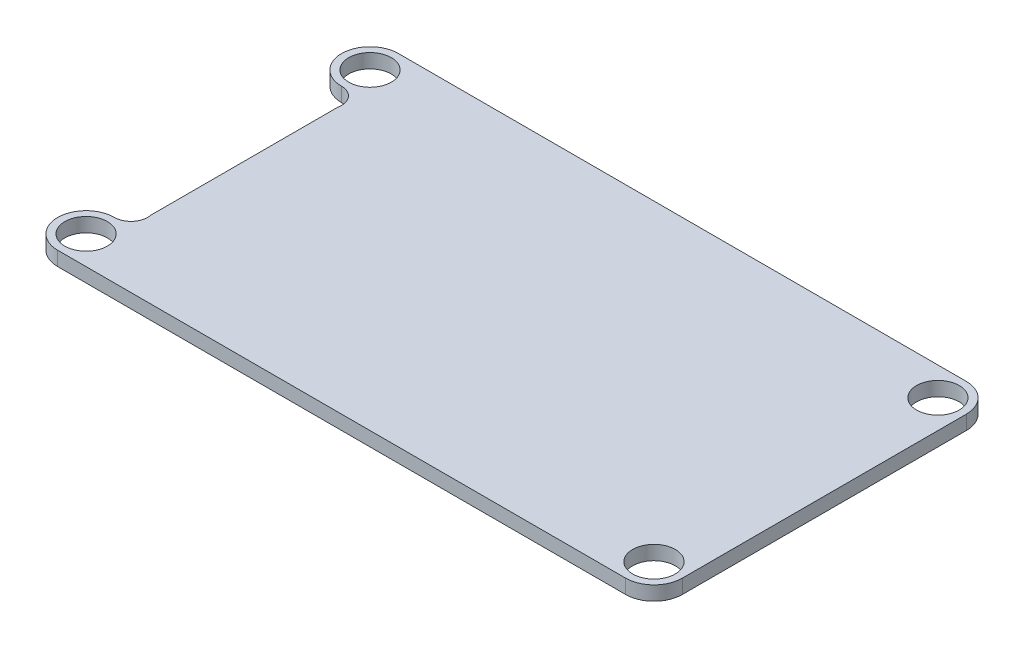
ISO-10303-21;
HEADER;
FILE_DESCRIPTION(('STEP AP214'),'2;1');
FILE_NAME('part.step','',(''),(''),'','','');
FILE_SCHEMA(('AUTOMOTIVE_DESIGN { 1 0 10303 214 1 1 1 1 }'));
ENDSEC;
DATA;
#1=APPLICATION_CONTEXT('core data for automotive mechanical design processes');
#2=APPLICATION_PROTOCOL_DEFINITION('international standard','automotive_design',2000,#1);
#3=PRODUCT_CONTEXT('',#1,'mechanical');
#4=PRODUCT('Part','Part','',(#3));
#5=PRODUCT_RELATED_PRODUCT_CATEGORY('part','',(#4));
#6=PRODUCT_DEFINITION_FORMATION('','',#4);
#7=PRODUCT_DEFINITION_CONTEXT('part definition',#1,'design');
#8=PRODUCT_DEFINITION('design','',#6,#7);
#9=PRODUCT_DEFINITION_SHAPE('','',#8);
#10=(LENGTH_UNIT() NAMED_UNIT(*) SI_UNIT(.MILLI.,.METRE.));
#11=(NAMED_UNIT(*) PLANE_ANGLE_UNIT() SI_UNIT($,.RADIAN.));
#12=(NAMED_UNIT(*) SI_UNIT($,.STERADIAN.) SOLID_ANGLE_UNIT());
#13=UNCERTAINTY_MEASURE_WITH_UNIT(LENGTH_MEASURE(1.E-05),#10,'distance_accuracy_value','');
#14=(GEOMETRIC_REPRESENTATION_CONTEXT(3) GLOBAL_UNCERTAINTY_ASSIGNED_CONTEXT((#13)) GLOBAL_UNIT_ASSIGNED_CONTEXT((#10,
#11,#12)) REPRESENTATION_CONTEXT('',''));
#15=CARTESIAN_POINT('',(0.,0.,0.));
#16=DIRECTION('',(0.,0.,1.));
#17=DIRECTION('',(1.,0.,0.));
#18=AXIS2_PLACEMENT_3D('',#15,#16,#17);
#19=CARTESIAN_POINT('',(-20.,1.,-10.));
#20=DIRECTION('',(0.,1.,0.));
#21=DIRECTION('',(0.,0.,1.));
#22=AXIS2_PLACEMENT_3D('',#19,#20,#21);
#23=PLANE('',#22);
#24=CARTESIAN_POINT('',(20.,1.,10.));
#25=DIRECTION('',(0.,1.,0.));
#26=DIRECTION('',(0.,0.,1.));
#27=AXIS2_PLACEMENT_3D('',#24,#25,#26);
#28=CIRCLE('',#27,1.5);
#29=CARTESIAN_POINT('',(20.,1.,11.5));
#30=VERTEX_POINT('',#29);
#31=EDGE_CURVE('E257',#30,#30,#28,.T.);
#32=ORIENTED_EDGE('',*,*,#31,.F.);
#33=EDGE_LOOP('',(#32));
#34=FACE_BOUND('',#33,.T.);
#35=CARTESIAN_POINT('',(-20.,1.,-10.));
#36=DIRECTION('',(0.,1.,0.));
#37=DIRECTION('',(0.,0.,1.));
#38=AXIS2_PLACEMENT_3D('',#35,#36,#37);
#39=CIRCLE('',#38,1.5);
#40=CARTESIAN_POINT('',(-20.,1.,-8.5));
#41=VERTEX_POINT('',#40);
#42=EDGE_CURVE('E158',#41,#41,#39,.T.);
#43=ORIENTED_EDGE('',*,*,#42,.F.);
#44=EDGE_LOOP('',(#43));
#45=FACE_BOUND('',#44,.T.);
#46=CARTESIAN_POINT('',(-20.,1.,-10.));
#47=DIRECTION('',(0.,1.,0.));
#48=DIRECTION('',(0.,0.,1.));
#49=AXIS2_PLACEMENT_3D('',#46,#47,#48);
#50=CIRCLE('',#49,2.);
#51=CARTESIAN_POINT('',(-20.,1.,-12.));
#52=VERTEX_POINT('',#51);
#53=CARTESIAN_POINT('',(-20.,1.,-8.));
#54=VERTEX_POINT('',#53);
#55=EDGE_CURVE('E182',#52,#54,#50,.T.);
#56=ORIENTED_EDGE('',*,*,#55,.T.);
#57=CARTESIAN_POINT('',(-20.,1.,-6.83585714285715));
#58=DIRECTION('',(0.,-1.,0.));
#59=DIRECTION('',(0.,0.,-1.));
#60=AXIS2_PLACEMENT_3D('',#57,#58,#59);
#61=CIRCLE('',#60,1.16414285714286);
#62=CARTESIAN_POINT('',(-18.86,1.,-6.6));
#63=VERTEX_POINT('',#62);
#64=EDGE_CURVE('E106',#54,#63,#61,.T.);
#65=ORIENTED_EDGE('',*,*,#64,.T.);
#66=DIRECTION('',(0.,0.,1.));
#67=VECTOR('',#66,1.);
#68=CARTESIAN_POINT('',(-18.86,1.,6.6));
#69=LINE('',#68,#67);
#70=CARTESIAN_POINT('',(-18.86,1.,6.6));
#71=VERTEX_POINT('',#70);
#72=EDGE_CURVE('E211',#63,#71,#69,.T.);
#73=ORIENTED_EDGE('',*,*,#72,.T.);
#74=CARTESIAN_POINT('',(-20.,1.,6.83585714285715));
#75=DIRECTION('',(0.,-1.,0.));
#76=DIRECTION('',(0.,0.,1.));
#77=AXIS2_PLACEMENT_3D('',#74,#75,#76);
#78=CIRCLE('',#77,1.16414285714286);
#79=CARTESIAN_POINT('',(-20.,1.,8.));
#80=VERTEX_POINT('',#79);
#81=EDGE_CURVE('E231',#71,#80,#78,.T.);
#82=ORIENTED_EDGE('',*,*,#81,.T.);
#83=CARTESIAN_POINT('',(-20.,1.,10.));
#84=DIRECTION('',(0.,1.,0.));
#85=DIRECTION('',(0.,0.,-1.));
#86=AXIS2_PLACEMENT_3D('',#83,#84,#85);
#87=CIRCLE('',#86,2.);
#88=CARTESIAN_POINT('',(-20.,1.,12.));
#89=VERTEX_POINT('',#88);
#90=EDGE_CURVE('E227',#80,#89,#87,.T.);
#91=ORIENTED_EDGE('',*,*,#90,.T.);
#92=DIRECTION('',(1.,0.,0.));
#93=VECTOR('',#92,1.);
#94=CARTESIAN_POINT('',(20.,1.,12.));
#95=LINE('',#94,#93);
#96=CARTESIAN_POINT('',(20.,1.,12.));
#97=VERTEX_POINT('',#96);
#98=EDGE_CURVE('E230',#89,#97,#95,.T.);
#99=ORIENTED_EDGE('',*,*,#98,.T.);
#100=CARTESIAN_POINT('',(20.,1.,10.));
#101=DIRECTION('',(0.,1.,0.));
#102=DIRECTION('',(0.,0.,-1.));
#103=AXIS2_PLACEMENT_3D('',#100,#101,#102);
#104=CIRCLE('',#103,2.);
#105=CARTESIAN_POINT('',(22.,1.,10.));
#106=VERTEX_POINT('',#105);
#107=EDGE_CURVE('E131',#97,#106,#104,.T.);
#108=ORIENTED_EDGE('',*,*,#107,.T.);
#109=DIRECTION('',(0.,0.,-1.));
#110=VECTOR('',#109,1.);
#111=CARTESIAN_POINT('',(22.,1.,-10.));
#112=LINE('',#111,#110);
#113=CARTESIAN_POINT('',(22.,1.,-10.));
#114=VERTEX_POINT('',#113);
#115=EDGE_CURVE('E125',#106,#114,#112,.T.);
#116=ORIENTED_EDGE('',*,*,#115,.T.);
#117=CARTESIAN_POINT('',(20.,1.,-10.));
#118=DIRECTION('',(0.,1.,0.));
#119=DIRECTION('',(0.,0.,-1.));
#120=AXIS2_PLACEMENT_3D('',#117,#118,#119);
#121=CIRCLE('',#120,2.);
#122=CARTESIAN_POINT('',(20.,1.,-12.));
#123=VERTEX_POINT('',#122);
#124=EDGE_CURVE('E129',#114,#123,#121,.T.);
#125=ORIENTED_EDGE('',*,*,#124,.T.);
#126=DIRECTION('',(-1.,0.,0.));
#127=VECTOR('',#126,1.);
#128=CARTESIAN_POINT('',(-20.,1.,-12.));
#129=LINE('',#128,#127);
#130=EDGE_CURVE('E57',#123,#52,#129,.T.);
#131=ORIENTED_EDGE('',*,*,#130,.T.);
#132=EDGE_LOOP('',(#56,#65,#73,#82,#91,#99,#108,#116,#125,#131));
#133=FACE_BOUND('',#132,.T.);
#134=CARTESIAN_POINT('',(-20.,1.,10.));
#135=DIRECTION('',(0.,1.,0.));
#136=DIRECTION('',(0.,0.,1.));
#137=AXIS2_PLACEMENT_3D('',#134,#135,#136);
#138=CIRCLE('',#137,1.5);
#139=CARTESIAN_POINT('',(-20.,1.,11.5));
#140=VERTEX_POINT('',#139);
#141=EDGE_CURVE('E249',#140,#140,#138,.T.);
#142=ORIENTED_EDGE('',*,*,#141,.F.);
#143=EDGE_LOOP('',(#142));
#144=FACE_BOUND('',#143,.T.);
#145=CARTESIAN_POINT('',(20.,1.,-10.));
#146=DIRECTION('',(0.,1.,0.));
#147=DIRECTION('',(0.,0.,1.));
#148=AXIS2_PLACEMENT_3D('',#145,#146,#147);
#149=CIRCLE('',#148,1.5);
#150=CARTESIAN_POINT('',(20.,1.,-8.5));
#151=VERTEX_POINT('',#150);
#152=EDGE_CURVE('E265',#151,#151,#149,.T.);
#153=ORIENTED_EDGE('',*,*,#152,.F.);
#154=EDGE_LOOP('',(#153));
#155=FACE_BOUND('',#154,.T.);
#156=ADVANCED_FACE('F39',(#34,#45,#133,#144,#155),#23,.T.);
#157=CARTESIAN_POINT('',(-20.,0.,-10.));
#158=DIRECTION('',(0.,1.,0.));
#159=DIRECTION('',(0.,0.,1.));
#160=AXIS2_PLACEMENT_3D('',#157,#158,#159);
#161=PLANE('',#160);
#162=CARTESIAN_POINT('',(-20.,0.,-10.));
#163=DIRECTION('',(0.,1.,0.));
#164=DIRECTION('',(0.,0.,1.));
#165=AXIS2_PLACEMENT_3D('',#162,#163,#164);
#166=CIRCLE('',#165,2.);
#167=CARTESIAN_POINT('',(-20.,0.,-12.));
#168=VERTEX_POINT('',#167);
#169=CARTESIAN_POINT('',(-20.,0.,-8.));
#170=VERTEX_POINT('',#169);
#171=EDGE_CURVE('E153',#168,#170,#166,.T.);
#172=ORIENTED_EDGE('',*,*,#171,.F.);
#173=DIRECTION('',(-1.,0.,0.));
#174=VECTOR('',#173,1.);
#175=CARTESIAN_POINT('',(-20.,0.,-12.));
#176=LINE('',#175,#174);
#177=CARTESIAN_POINT('',(20.,0.,-12.));
#178=VERTEX_POINT('',#177);
#179=EDGE_CURVE('E98',#178,#168,#176,.T.);
#180=ORIENTED_EDGE('',*,*,#179,.F.);
#181=CARTESIAN_POINT('',(20.,0.,-10.));
#182=DIRECTION('',(0.,1.,0.));
#183=DIRECTION('',(0.,0.,-1.));
#184=AXIS2_PLACEMENT_3D('',#181,#182,#183);
#185=CIRCLE('',#184,2.);
#186=CARTESIAN_POINT('',(22.,0.,-10.));
#187=VERTEX_POINT('',#186);
#188=EDGE_CURVE('E92',#187,#178,#185,.T.);
#189=ORIENTED_EDGE('',*,*,#188,.F.);
#190=DIRECTION('',(0.,0.,-1.));
#191=VECTOR('',#190,1.);
#192=CARTESIAN_POINT('',(22.,0.,-10.));
#193=LINE('',#192,#191);
#194=CARTESIAN_POINT('',(22.,0.,10.));
#195=VERTEX_POINT('',#194);
#196=EDGE_CURVE('E140',#195,#187,#193,.T.);
#197=ORIENTED_EDGE('',*,*,#196,.F.);
#198=CARTESIAN_POINT('',(20.,0.,10.));
#199=DIRECTION('',(0.,1.,0.));
#200=DIRECTION('',(0.,0.,-1.));
#201=AXIS2_PLACEMENT_3D('',#198,#199,#200);
#202=CIRCLE('',#201,2.);
#203=CARTESIAN_POINT('',(20.,0.,12.));
#204=VERTEX_POINT('',#203);
#205=EDGE_CURVE('E173',#204,#195,#202,.T.);
#206=ORIENTED_EDGE('',*,*,#205,.F.);
#207=DIRECTION('',(1.,0.,0.));
#208=VECTOR('',#207,1.);
#209=CARTESIAN_POINT('',(20.,0.,12.));
#210=LINE('',#209,#208);
#211=CARTESIAN_POINT('',(-20.,0.,12.));
#212=VERTEX_POINT('',#211);
#213=EDGE_CURVE('E170',#212,#204,#210,.T.);
#214=ORIENTED_EDGE('',*,*,#213,.F.);
#215=CARTESIAN_POINT('',(-20.,0.,10.));
#216=DIRECTION('',(0.,1.,0.));
#217=DIRECTION('',(0.,0.,-1.));
#218=AXIS2_PLACEMENT_3D('',#215,#216,#217);
#219=CIRCLE('',#218,2.);
#220=CARTESIAN_POINT('',(-20.,0.,8.));
#221=VERTEX_POINT('',#220);
#222=EDGE_CURVE('E167',#221,#212,#219,.T.);
#223=ORIENTED_EDGE('',*,*,#222,.F.);
#224=CARTESIAN_POINT('',(-20.,0.,6.83585714285715));
#225=DIRECTION('',(0.,-1.,0.));
#226=DIRECTION('',(0.,0.,1.));
#227=AXIS2_PLACEMENT_3D('',#224,#225,#226);
#228=CIRCLE('',#227,1.16414285714286);
#229=CARTESIAN_POINT('',(-18.86,0.,6.6));
#230=VERTEX_POINT('',#229);
#231=EDGE_CURVE('E164',#230,#221,#228,.T.);
#232=ORIENTED_EDGE('',*,*,#231,.F.);
#233=DIRECTION('',(0.,0.,1.));
#234=VECTOR('',#233,1.);
#235=CARTESIAN_POINT('',(-18.86,0.,6.6));
#236=LINE('',#235,#234);
#237=CARTESIAN_POINT('',(-18.86,0.,-6.6));
#238=VERTEX_POINT('',#237);
#239=EDGE_CURVE('E161',#238,#230,#236,.T.);
#240=ORIENTED_EDGE('',*,*,#239,.F.);
#241=CARTESIAN_POINT('',(-20.,0.,-6.83585714285715));
#242=DIRECTION('',(0.,-1.,0.));
#243=DIRECTION('',(0.,0.,-1.));
#244=AXIS2_PLACEMENT_3D('',#241,#242,#243);
#245=CIRCLE('',#244,1.16414285714286);
#246=EDGE_CURVE('E157',#170,#238,#245,.T.);
#247=ORIENTED_EDGE('',*,*,#246,.F.);
#248=EDGE_LOOP('',(#172,#180,#189,#197,#206,#214,#223,#232,#240,#247));
#249=FACE_BOUND('',#248,.T.);
#250=CARTESIAN_POINT('',(-20.,0.,-10.));
#251=DIRECTION('',(0.,1.,0.));
#252=DIRECTION('',(0.,0.,1.));
#253=AXIS2_PLACEMENT_3D('',#250,#251,#252);
#254=CIRCLE('',#253,1.5);
#255=CARTESIAN_POINT('',(-20.,0.,-8.5));
#256=VERTEX_POINT('',#255);
#257=EDGE_CURVE('E245',#256,#256,#254,.T.);
#258=ORIENTED_EDGE('',*,*,#257,.T.);
#259=EDGE_LOOP('',(#258));
#260=FACE_BOUND('',#259,.T.);
#261=CARTESIAN_POINT('',(-20.,0.,10.));
#262=DIRECTION('',(0.,1.,0.));
#263=DIRECTION('',(0.,0.,1.));
#264=AXIS2_PLACEMENT_3D('',#261,#262,#263);
#265=CIRCLE('',#264,1.5);
#266=CARTESIAN_POINT('',(-20.,0.,11.5));
#267=VERTEX_POINT('',#266);
#268=EDGE_CURVE('E253',#267,#267,#265,.T.);
#269=ORIENTED_EDGE('',*,*,#268,.T.);
#270=EDGE_LOOP('',(#269));
#271=FACE_BOUND('',#270,.T.);
#272=CARTESIAN_POINT('',(20.,0.,10.));
#273=DIRECTION('',(0.,1.,0.));
#274=DIRECTION('',(0.,0.,1.));
#275=AXIS2_PLACEMENT_3D('',#272,#273,#274);
#276=CIRCLE('',#275,1.5);
#277=CARTESIAN_POINT('',(20.,0.,11.5));
#278=VERTEX_POINT('',#277);
#279=EDGE_CURVE('E261',#278,#278,#276,.T.);
#280=ORIENTED_EDGE('',*,*,#279,.T.);
#281=EDGE_LOOP('',(#280));
#282=FACE_BOUND('',#281,.T.);
#283=CARTESIAN_POINT('',(20.,0.,-10.));
#284=DIRECTION('',(0.,1.,0.));
#285=DIRECTION('',(0.,0.,1.));
#286=AXIS2_PLACEMENT_3D('',#283,#284,#285);
#287=CIRCLE('',#286,1.5);
#288=CARTESIAN_POINT('',(20.,0.,-8.5));
#289=VERTEX_POINT('',#288);
#290=EDGE_CURVE('E269',#289,#289,#287,.T.);
#291=ORIENTED_EDGE('',*,*,#290,.T.);
#292=EDGE_LOOP('',(#291));
#293=FACE_BOUND('',#292,.T.);
#294=ADVANCED_FACE('F215',(#249,#260,#271,#282,#293),#161,.F.);
#295=CARTESIAN_POINT('',(-20.,1.,-10.));
#296=DIRECTION('',(0.,-1.,0.));
#297=DIRECTION('',(0.,0.,-1.));
#298=AXIS2_PLACEMENT_3D('',#295,#296,#297);
#299=CYLINDRICAL_SURFACE('',#298,2.);
#300=ORIENTED_EDGE('',*,*,#171,.T.);
#301=DIRECTION('',(0.,-1.,0.));
#302=VECTOR('',#301,1.);
#303=CARTESIAN_POINT('',(-20.,1.,-8.));
#304=LINE('',#303,#302);
#305=EDGE_CURVE('E11',#54,#170,#304,.T.);
#306=ORIENTED_EDGE('',*,*,#305,.F.);
#307=ORIENTED_EDGE('',*,*,#55,.F.);
#308=DIRECTION('',(0.,-1.,0.));
#309=VECTOR('',#308,1.);
#310=CARTESIAN_POINT('',(-20.,1.,-12.));
#311=LINE('',#310,#309);
#312=EDGE_CURVE('E149',#52,#168,#311,.T.);
#313=ORIENTED_EDGE('',*,*,#312,.T.);
#314=EDGE_LOOP('',(#300,#306,#307,#313));
#315=FACE_BOUND('',#314,.T.);
#316=ADVANCED_FACE('F41',(#315),#299,.T.);
#317=CARTESIAN_POINT('',(-20.,1.,-6.83585714285715));
#318=DIRECTION('',(0.,-1.,0.));
#319=DIRECTION('',(0.,0.,-1.));
#320=AXIS2_PLACEMENT_3D('',#317,#318,#319);
#321=CYLINDRICAL_SURFACE('',#320,1.16414285714286);
#322=ORIENTED_EDGE('',*,*,#246,.T.);
#323=DIRECTION('',(0.,-1.,0.));
#324=VECTOR('',#323,1.);
#325=CARTESIAN_POINT('',(-18.86,1.,-6.6));
#326=LINE('',#325,#324);
#327=EDGE_CURVE('E49',#63,#238,#326,.T.);
#328=ORIENTED_EDGE('',*,*,#327,.F.);
#329=ORIENTED_EDGE('',*,*,#64,.F.);
#330=ORIENTED_EDGE('',*,*,#305,.T.);
#331=EDGE_LOOP('',(#322,#328,#329,#330));
#332=FACE_BOUND('',#331,.T.);
#333=ADVANCED_FACE('F313',(#332),#321,.F.);
#334=CARTESIAN_POINT('',(-18.86,1.,6.6));
#335=DIRECTION('',(1.,0.,0.));
#336=DIRECTION('',(0.,0.,-1.));
#337=AXIS2_PLACEMENT_3D('',#334,#335,#336);
#338=PLANE('',#337);
#339=ORIENTED_EDGE('',*,*,#239,.T.);
#340=DIRECTION('',(0.,-1.,0.));
#341=VECTOR('',#340,1.);
#342=CARTESIAN_POINT('',(-18.86,1.,6.6));
#343=LINE('',#342,#341);
#344=EDGE_CURVE('E201',#71,#230,#343,.T.);
#345=ORIENTED_EDGE('',*,*,#344,.F.);
#346=ORIENTED_EDGE('',*,*,#72,.F.);
#347=ORIENTED_EDGE('',*,*,#327,.T.);
#348=EDGE_LOOP('',(#339,#345,#346,#347));
#349=FACE_BOUND('',#348,.T.);
#350=ADVANCED_FACE('F209',(#349),#338,.F.);
#351=CARTESIAN_POINT('',(-20.,1.,6.83585714285715));
#352=DIRECTION('',(0.,-1.,0.));
#353=DIRECTION('',(0.,0.,-1.));
#354=AXIS2_PLACEMENT_3D('',#351,#352,#353);
#355=CYLINDRICAL_SURFACE('',#354,1.16414285714286);
#356=ORIENTED_EDGE('',*,*,#231,.T.);
#357=DIRECTION('',(0.,-1.,0.));
#358=VECTOR('',#357,1.);
#359=CARTESIAN_POINT('',(-20.,1.,8.));
#360=LINE('',#359,#358);
#361=EDGE_CURVE('E197',#80,#221,#360,.T.);
#362=ORIENTED_EDGE('',*,*,#361,.F.);
#363=ORIENTED_EDGE('',*,*,#81,.F.);
#364=ORIENTED_EDGE('',*,*,#344,.T.);
#365=EDGE_LOOP('',(#356,#362,#363,#364));
#366=FACE_BOUND('',#365,.T.);
#367=ADVANCED_FACE('F221',(#366),#355,.F.);
#368=CARTESIAN_POINT('',(-20.,1.,10.));
#369=DIRECTION('',(0.,-1.,0.));
#370=DIRECTION('',(0.,0.,-1.));
#371=AXIS2_PLACEMENT_3D('',#368,#369,#370);
#372=CYLINDRICAL_SURFACE('',#371,2.);
#373=ORIENTED_EDGE('',*,*,#222,.T.);
#374=DIRECTION('',(0.,-1.,0.));
#375=VECTOR('',#374,1.);
#376=CARTESIAN_POINT('',(-20.,1.,12.));
#377=LINE('',#376,#375);
#378=EDGE_CURVE('E193',#89,#212,#377,.T.);
#379=ORIENTED_EDGE('',*,*,#378,.F.);
#380=ORIENTED_EDGE('',*,*,#90,.F.);
#381=ORIENTED_EDGE('',*,*,#361,.T.);
#382=EDGE_LOOP('',(#373,#379,#380,#381));
#383=FACE_BOUND('',#382,.T.);
#384=ADVANCED_FACE('F225',(#383),#372,.T.);
#385=CARTESIAN_POINT('',(20.,1.,12.));
#386=DIRECTION('',(0.,0.,-1.));
#387=DIRECTION('',(-1.,0.,0.));
#388=AXIS2_PLACEMENT_3D('',#385,#386,#387);
#389=PLANE('',#388);
#390=ORIENTED_EDGE('',*,*,#213,.T.);
#391=DIRECTION('',(0.,-1.,0.));
#392=VECTOR('',#391,1.);
#393=CARTESIAN_POINT('',(20.,1.,12.));
#394=LINE('',#393,#392);
#395=EDGE_CURVE('E189',#97,#204,#394,.T.);
#396=ORIENTED_EDGE('',*,*,#395,.F.);
#397=ORIENTED_EDGE('',*,*,#98,.F.);
#398=ORIENTED_EDGE('',*,*,#378,.T.);
#399=EDGE_LOOP('',(#390,#396,#397,#398));
#400=FACE_BOUND('',#399,.T.);
#401=ADVANCED_FACE('F303',(#400),#389,.F.);
#402=CARTESIAN_POINT('',(20.,1.,10.));
#403=DIRECTION('',(0.,-1.,0.));
#404=DIRECTION('',(0.,0.,-1.));
#405=AXIS2_PLACEMENT_3D('',#402,#403,#404);
#406=CYLINDRICAL_SURFACE('',#405,2.);
#407=ORIENTED_EDGE('',*,*,#205,.T.);
#408=DIRECTION('',(0.,-1.,0.));
#409=VECTOR('',#408,1.);
#410=CARTESIAN_POINT('',(22.,1.,10.));
#411=LINE('',#410,#409);
#412=EDGE_CURVE('E142',#106,#195,#411,.T.);
#413=ORIENTED_EDGE('',*,*,#412,.F.);
#414=ORIENTED_EDGE('',*,*,#107,.F.);
#415=ORIENTED_EDGE('',*,*,#395,.T.);
#416=EDGE_LOOP('',(#407,#413,#414,#415));
#417=FACE_BOUND('',#416,.T.);
#418=ADVANCED_FACE('F300',(#417),#406,.T.);
#419=CARTESIAN_POINT('',(22.,1.,-10.));
#420=DIRECTION('',(-1.,0.,0.));
#421=DIRECTION('',(0.,0.,1.));
#422=AXIS2_PLACEMENT_3D('',#419,#420,#421);
#423=PLANE('',#422);
#424=ORIENTED_EDGE('',*,*,#196,.T.);
#425=DIRECTION('',(0.,-1.,0.));
#426=VECTOR('',#425,1.);
#427=CARTESIAN_POINT('',(22.,1.,-10.));
#428=LINE('',#427,#426);
#429=EDGE_CURVE('E137',#114,#187,#428,.T.);
#430=ORIENTED_EDGE('',*,*,#429,.F.);
#431=ORIENTED_EDGE('',*,*,#115,.F.);
#432=ORIENTED_EDGE('',*,*,#412,.T.);
#433=EDGE_LOOP('',(#424,#430,#431,#432));
#434=FACE_BOUND('',#433,.T.);
#435=ADVANCED_FACE('F138',(#434),#423,.F.);
#436=CARTESIAN_POINT('',(20.,1.,-10.));
#437=DIRECTION('',(0.,-1.,0.));
#438=DIRECTION('',(0.,0.,-1.));
#439=AXIS2_PLACEMENT_3D('',#436,#437,#438);
#440=CYLINDRICAL_SURFACE('',#439,2.);
#441=ORIENTED_EDGE('',*,*,#188,.T.);
#442=DIRECTION('',(0.,-1.,0.));
#443=VECTOR('',#442,1.);
#444=CARTESIAN_POINT('',(20.,1.,-12.));
#445=LINE('',#444,#443);
#446=EDGE_CURVE('E143',#123,#178,#445,.T.);
#447=ORIENTED_EDGE('',*,*,#446,.F.);
#448=ORIENTED_EDGE('',*,*,#124,.F.);
#449=ORIENTED_EDGE('',*,*,#429,.T.);
#450=EDGE_LOOP('',(#441,#447,#448,#449));
#451=FACE_BOUND('',#450,.T.);
#452=ADVANCED_FACE('F145',(#451),#440,.T.);
#453=CARTESIAN_POINT('',(-20.,1.,-12.));
#454=DIRECTION('',(0.,0.,1.));
#455=DIRECTION('',(1.,0.,0.));
#456=AXIS2_PLACEMENT_3D('',#453,#454,#455);
#457=PLANE('',#456);
#458=ORIENTED_EDGE('',*,*,#179,.T.);
#459=ORIENTED_EDGE('',*,*,#312,.F.);
#460=ORIENTED_EDGE('',*,*,#130,.F.);
#461=ORIENTED_EDGE('',*,*,#446,.T.);
#462=EDGE_LOOP('',(#458,#459,#460,#461));
#463=FACE_BOUND('',#462,.T.);
#464=ADVANCED_FACE('F293',(#463),#457,.F.);
#465=CARTESIAN_POINT('',(-20.,1.,-10.));
#466=DIRECTION('',(0.,-1.,0.));
#467=DIRECTION('',(0.,0.,-1.));
#468=AXIS2_PLACEMENT_3D('',#465,#466,#467);
#469=CYLINDRICAL_SURFACE('',#468,1.5);
#470=ORIENTED_EDGE('',*,*,#42,.T.);
#471=EDGE_LOOP('',(#470));
#472=FACE_BOUND('',#471,.T.);
#473=ORIENTED_EDGE('',*,*,#257,.F.);
#474=EDGE_LOOP('',(#473));
#475=FACE_BOUND('',#474,.T.);
#476=ADVANCED_FACE('F290',(#472,#475),#469,.F.);
#477=CARTESIAN_POINT('',(-20.,1.,10.));
#478=DIRECTION('',(0.,-1.,0.));
#479=DIRECTION('',(0.,0.,-1.));
#480=AXIS2_PLACEMENT_3D('',#477,#478,#479);
#481=CYLINDRICAL_SURFACE('',#480,1.5);
#482=ORIENTED_EDGE('',*,*,#141,.T.);
#483=EDGE_LOOP('',(#482));
#484=FACE_BOUND('',#483,.T.);
#485=ORIENTED_EDGE('',*,*,#268,.F.);
#486=EDGE_LOOP('',(#485));
#487=FACE_BOUND('',#486,.T.);
#488=ADVANCED_FACE('F389',(#484,#487),#481,.F.);
#489=CARTESIAN_POINT('',(20.,1.,10.));
#490=DIRECTION('',(0.,-1.,0.));
#491=DIRECTION('',(0.,0.,-1.));
#492=AXIS2_PLACEMENT_3D('',#489,#490,#491);
#493=CYLINDRICAL_SURFACE('',#492,1.5);
#494=ORIENTED_EDGE('',*,*,#31,.T.);
#495=EDGE_LOOP('',(#494));
#496=FACE_BOUND('',#495,.T.);
#497=ORIENTED_EDGE('',*,*,#279,.F.);
#498=EDGE_LOOP('',(#497));
#499=FACE_BOUND('',#498,.T.);
#500=ADVANCED_FACE('F397',(#496,#499),#493,.F.);
#501=CARTESIAN_POINT('',(20.,1.,-10.));
#502=DIRECTION('',(0.,-1.,0.));
#503=DIRECTION('',(0.,0.,-1.));
#504=AXIS2_PLACEMENT_3D('',#501,#502,#503);
#505=CYLINDRICAL_SURFACE('',#504,1.5);
#506=ORIENTED_EDGE('',*,*,#152,.T.);
#507=EDGE_LOOP('',(#506));
#508=FACE_BOUND('',#507,.T.);
#509=ORIENTED_EDGE('',*,*,#290,.F.);
#510=EDGE_LOOP('',(#509));
#511=FACE_BOUND('',#510,.T.);
#512=ADVANCED_FACE('F277',(#508,#511),#505,.F.);
#513=CLOSED_SHELL('',(#156,#294,#316,#333,#350,#367,#384,#401,#418,#435,#452,#464,#476,#488,
#500,#512));
#514=MANIFOLD_SOLID_BREP('B2',#513);
#515=ADVANCED_BREP_SHAPE_REPRESENTATION('',(#18,#514),#14);
#516=SHAPE_DEFINITION_REPRESENTATION(#9,#515);
ENDSEC;
END-ISO-10303-21;
